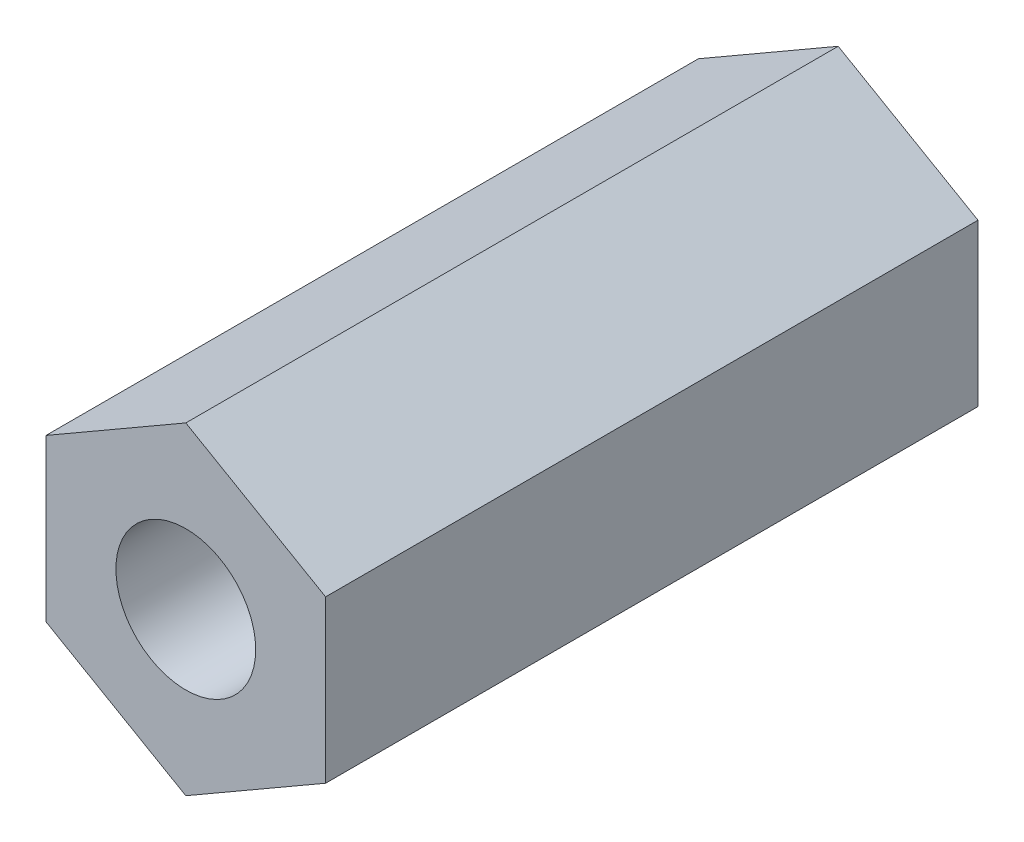
ISO-10303-21;
HEADER;
FILE_DESCRIPTION(('STEP AP214'),'2;1');
FILE_NAME('part.step','',(''),(''),'','','');
FILE_SCHEMA(('AUTOMOTIVE_DESIGN { 1 0 10303 214 1 1 1 1 }'));
ENDSEC;
DATA;
#1=APPLICATION_CONTEXT('core data for automotive mechanical design processes');
#2=APPLICATION_PROTOCOL_DEFINITION('international standard','automotive_design',2000,#1);
#3=PRODUCT_CONTEXT('',#1,'mechanical');
#4=PRODUCT('Part','Part','',(#3));
#5=PRODUCT_RELATED_PRODUCT_CATEGORY('part','',(#4));
#6=PRODUCT_DEFINITION_FORMATION('','',#4);
#7=PRODUCT_DEFINITION_CONTEXT('part definition',#1,'design');
#8=PRODUCT_DEFINITION('design','',#6,#7);
#9=PRODUCT_DEFINITION_SHAPE('','',#8);
#10=(LENGTH_UNIT() NAMED_UNIT(*) SI_UNIT(.MILLI.,.METRE.));
#11=(NAMED_UNIT(*) PLANE_ANGLE_UNIT() SI_UNIT($,.RADIAN.));
#12=(NAMED_UNIT(*) SI_UNIT($,.STERADIAN.) SOLID_ANGLE_UNIT());
#13=UNCERTAINTY_MEASURE_WITH_UNIT(LENGTH_MEASURE(1.E-05),#10,'distance_accuracy_value','');
#14=(GEOMETRIC_REPRESENTATION_CONTEXT(3) GLOBAL_UNCERTAINTY_ASSIGNED_CONTEXT((#13)) GLOBAL_UNIT_ASSIGNED_CONTEXT((#10,
#11,#12)) REPRESENTATION_CONTEXT('',''));
#15=CARTESIAN_POINT('',(0.,0.,0.));
#16=DIRECTION('',(0.,0.,1.));
#17=DIRECTION('',(1.,0.,0.));
#18=AXIS2_PLACEMENT_3D('',#15,#16,#17);
#19=CARTESIAN_POINT('',(0.,3.46410161513769,6.99999999999978));
#20=DIRECTION('',(0.,0.,1.));
#21=DIRECTION('',(1.,0.,0.));
#22=AXIS2_PLACEMENT_3D('',#19,#20,#21);
#23=PLANE('',#22);
#24=DIRECTION('',(-0.866025403784441,0.500000000000001,0.));
#25=VECTOR('',#24,1.);
#26=CARTESIAN_POINT('',(3.00000000000007,1.73205080756883,6.9999999999999));
#27=LINE('',#26,#25);
#28=CARTESIAN_POINT('',(3.00000000000007,1.73205080756883,6.9999999999999));
#29=VERTEX_POINT('',#28);
#30=CARTESIAN_POINT('',(0.,3.46410161513769,6.99999999999978));
#31=VERTEX_POINT('',#30);
#32=EDGE_CURVE('E121',#29,#31,#27,.T.);
#33=ORIENTED_EDGE('',*,*,#32,.T.);
#34=DIRECTION('',(-0.86602540378444,-0.500000000000002,0.));
#35=VECTOR('',#34,1.);
#36=CARTESIAN_POINT('',(0.,3.46410161513769,6.99999999999978));
#37=LINE('',#36,#35);
#38=CARTESIAN_POINT('',(-3.00000000000006,1.73205080756875,7.00000000000001));
#39=VERTEX_POINT('',#38);
#40=EDGE_CURVE('E88',#31,#39,#37,.T.);
#41=ORIENTED_EDGE('',*,*,#40,.T.);
#42=DIRECTION('',(0.,-1.,0.));
#43=VECTOR('',#42,1.);
#44=CARTESIAN_POINT('',(-3.00000000000006,1.73205080756875,7.00000000000001));
#45=LINE('',#44,#43);
#46=CARTESIAN_POINT('',(-3.00000000000001,-1.732050807569,7.00000000000001));
#47=VERTEX_POINT('',#46);
#48=EDGE_CURVE('E124',#39,#47,#45,.T.);
#49=ORIENTED_EDGE('',*,*,#48,.T.);
#50=DIRECTION('',(0.866025403784441,-0.500000000000001,0.));
#51=VECTOR('',#50,1.);
#52=CARTESIAN_POINT('',(-3.00000000000001,-1.732050807569,7.00000000000001));
#53=LINE('',#52,#51);
#54=CARTESIAN_POINT('',(-1.11022302462516E-13,-3.46410161513777,7.00000000000012));
#55=VERTEX_POINT('',#54);
#56=EDGE_CURVE('E126',#47,#55,#53,.T.);
#57=ORIENTED_EDGE('',*,*,#56,.T.);
#58=DIRECTION('',(0.86602540378444,0.500000000000002,0.));
#59=VECTOR('',#58,1.);
#60=CARTESIAN_POINT('',(-1.11022302462516E-13,-3.46410161513777,7.00000000000012));
#61=LINE('',#60,#59);
#62=CARTESIAN_POINT('',(3.00000000000001,-1.73205080756897,7.00000000000012));
#63=VERTEX_POINT('',#62);
#64=EDGE_CURVE('E52',#55,#63,#61,.T.);
#65=ORIENTED_EDGE('',*,*,#64,.T.);
#66=DIRECTION('',(0.,1.,0.));
#67=VECTOR('',#66,1.);
#68=CARTESIAN_POINT('',(3.00000000000001,-1.73205080756897,7.00000000000012));
#69=LINE('',#68,#67);
#70=EDGE_CURVE('E47',#63,#29,#69,.T.);
#71=ORIENTED_EDGE('',*,*,#70,.T.);
#72=EDGE_LOOP('',(#33,#41,#49,#57,#65,#71));
#73=FACE_BOUND('',#72,.T.);
#74=CARTESIAN_POINT('',(0.,0.,7.00000000000001));
#75=DIRECTION('',(0.,0.,1.));
#76=DIRECTION('',(1.,0.,0.));
#77=AXIS2_PLACEMENT_3D('',#74,#75,#76);
#78=CIRCLE('',#77,1.5);
#79=CARTESIAN_POINT('',(1.5,0.,7.00000000000001));
#80=VERTEX_POINT('',#79);
#81=EDGE_CURVE('E118',#80,#80,#78,.T.);
#82=ORIENTED_EDGE('',*,*,#81,.F.);
#83=EDGE_LOOP('',(#82));
#84=FACE_BOUND('',#83,.T.);
#85=ADVANCED_FACE('F32',(#73,#84),#23,.T.);
#86=CARTESIAN_POINT('',(3.00000000000007,1.73205080756883,6.9999999999999));
#87=DIRECTION('',(-0.5,-0.866025403784442,0.));
#88=DIRECTION('',(0.866025403784441,-0.500000000000001,0.));
#89=AXIS2_PLACEMENT_3D('',#86,#87,#88);
#90=PLANE('',#89);
#91=DIRECTION('',(0.,0.,-1.));
#92=VECTOR('',#91,1.);
#93=CARTESIAN_POINT('',(3.00000000000007,1.73205080756883,6.9999999999999));
#94=LINE('',#93,#92);
#95=CARTESIAN_POINT('',(3.00000000000006,1.73205080756877,-7.00000000000012));
#96=VERTEX_POINT('',#95);
#97=EDGE_CURVE('E103',#29,#96,#94,.T.);
#98=ORIENTED_EDGE('',*,*,#97,.T.);
#99=DIRECTION('',(-0.866025403784441,0.500000000000001,0.));
#100=VECTOR('',#99,1.);
#101=CARTESIAN_POINT('',(3.00000000000006,1.73205080756877,-7.00000000000012));
#102=LINE('',#101,#100);
#103=CARTESIAN_POINT('',(-1.17961196366423E-13,3.4641016151376,-7.00000000000023));
#104=VERTEX_POINT('',#103);
#105=EDGE_CURVE('E97',#96,#104,#102,.T.);
#106=ORIENTED_EDGE('',*,*,#105,.T.);
#107=DIRECTION('',(0.,0.,-1.));
#108=VECTOR('',#107,1.);
#109=CARTESIAN_POINT('',(0.,3.46410161513769,6.99999999999978));
#110=LINE('',#109,#108);
#111=EDGE_CURVE('E11',#31,#104,#110,.T.);
#112=ORIENTED_EDGE('',*,*,#111,.F.);
#113=ORIENTED_EDGE('',*,*,#32,.F.);
#114=EDGE_LOOP('',(#98,#106,#112,#113));
#115=FACE_BOUND('',#114,.T.);
#116=ADVANCED_FACE('F34',(#115),#90,.F.);
#117=CARTESIAN_POINT('',(0.,3.46410161513769,6.99999999999978));
#118=DIRECTION('',(0.500000000000002,-0.866025403784441,0.));
#119=DIRECTION('',(0.86602540378444,0.500000000000002,0.));
#120=AXIS2_PLACEMENT_3D('',#117,#118,#119);
#121=PLANE('',#120);
#122=ORIENTED_EDGE('',*,*,#111,.T.);
#123=DIRECTION('',(-0.86602540378444,-0.500000000000002,0.));
#124=VECTOR('',#123,1.);
#125=CARTESIAN_POINT('',(-1.17961196366423E-13,3.4641016151376,-7.00000000000023));
#126=LINE('',#125,#124);
#127=CARTESIAN_POINT('',(-3.00000000000005,1.73205080756872,-7.00000000000001));
#128=VERTEX_POINT('',#127);
#129=EDGE_CURVE('E87',#104,#128,#126,.T.);
#130=ORIENTED_EDGE('',*,*,#129,.T.);
#131=DIRECTION('',(0.,0.,-1.));
#132=VECTOR('',#131,1.);
#133=CARTESIAN_POINT('',(-3.00000000000006,1.73205080756875,7.00000000000001));
#134=LINE('',#133,#132);
#135=EDGE_CURVE('E40',#39,#128,#134,.T.);
#136=ORIENTED_EDGE('',*,*,#135,.F.);
#137=ORIENTED_EDGE('',*,*,#40,.F.);
#138=EDGE_LOOP('',(#122,#130,#136,#137));
#139=FACE_BOUND('',#138,.T.);
#140=ADVANCED_FACE('F85',(#139),#121,.F.);
#141=CARTESIAN_POINT('',(-3.00000000000006,1.73205080756875,7.00000000000001));
#142=DIRECTION('',(1.,0.,0.));
#143=DIRECTION('',(0.,0.,-1.));
#144=AXIS2_PLACEMENT_3D('',#141,#142,#143);
#145=PLANE('',#144);
#146=ORIENTED_EDGE('',*,*,#135,.T.);
#147=DIRECTION('',(0.,-1.,0.));
#148=VECTOR('',#147,1.);
#149=CARTESIAN_POINT('',(-3.00000000000005,1.73205080756872,-7.00000000000001));
#150=LINE('',#149,#148);
#151=CARTESIAN_POINT('',(-3.00000000000001,-1.73205080756905,-7.00000000000001));
#152=VERTEX_POINT('',#151);
#153=EDGE_CURVE('E101',#128,#152,#150,.T.);
#154=ORIENTED_EDGE('',*,*,#153,.T.);
#155=DIRECTION('',(0.,0.,-1.));
#156=VECTOR('',#155,1.);
#157=CARTESIAN_POINT('',(-3.00000000000001,-1.732050807569,7.00000000000001));
#158=LINE('',#157,#156);
#159=EDGE_CURVE('E135',#47,#152,#158,.T.);
#160=ORIENTED_EDGE('',*,*,#159,.F.);
#161=ORIENTED_EDGE('',*,*,#48,.F.);
#162=EDGE_LOOP('',(#146,#154,#160,#161));
#163=FACE_BOUND('',#162,.T.);
#164=ADVANCED_FACE('F138',(#163),#145,.F.);
#165=CARTESIAN_POINT('',(-3.00000000000001,-1.732050807569,7.00000000000001));
#166=DIRECTION('',(0.5,0.866025403784442,0.));
#167=DIRECTION('',(-0.866025403784441,0.500000000000001,0.));
#168=AXIS2_PLACEMENT_3D('',#165,#166,#167);
#169=PLANE('',#168);
#170=ORIENTED_EDGE('',*,*,#159,.T.);
#171=DIRECTION('',(0.866025403784441,-0.500000000000001,0.));
#172=VECTOR('',#171,1.);
#173=CARTESIAN_POINT('',(-3.00000000000001,-1.73205080756905,-7.00000000000001));
#174=LINE('',#173,#172);
#175=CARTESIAN_POINT('',(0.,-3.46410161513799,-6.9999999999999));
#176=VERTEX_POINT('',#175);
#177=EDGE_CURVE('E110',#152,#176,#174,.T.);
#178=ORIENTED_EDGE('',*,*,#177,.T.);
#179=DIRECTION('',(0.,0.,-1.));
#180=VECTOR('',#179,1.);
#181=CARTESIAN_POINT('',(-1.11022302462516E-13,-3.46410161513777,7.00000000000012));
#182=LINE('',#181,#180);
#183=EDGE_CURVE('E133',#55,#176,#182,.T.);
#184=ORIENTED_EDGE('',*,*,#183,.F.);
#185=ORIENTED_EDGE('',*,*,#56,.F.);
#186=EDGE_LOOP('',(#170,#178,#184,#185));
#187=FACE_BOUND('',#186,.T.);
#188=ADVANCED_FACE('F144',(#187),#169,.F.);
#189=CARTESIAN_POINT('',(-1.11022302462516E-13,-3.46410161513777,7.00000000000012));
#190=DIRECTION('',(-0.500000000000002,0.866025403784442,0.));
#191=DIRECTION('',(-0.86602540378444,-0.500000000000002,0.));
#192=AXIS2_PLACEMENT_3D('',#189,#190,#191);
#193=PLANE('',#192);
#194=ORIENTED_EDGE('',*,*,#183,.T.);
#195=DIRECTION('',(0.86602540378444,0.500000000000002,0.));
#196=VECTOR('',#195,1.);
#197=CARTESIAN_POINT('',(0.,-3.46410161513799,-6.9999999999999));
#198=LINE('',#197,#196);
#199=CARTESIAN_POINT('',(3.00000000000001,-1.73205080756902,-6.9999999999999));
#200=VERTEX_POINT('',#199);
#201=EDGE_CURVE('E113',#176,#200,#198,.T.);
#202=ORIENTED_EDGE('',*,*,#201,.T.);
#203=DIRECTION('',(0.,0.,-1.));
#204=VECTOR('',#203,1.);
#205=CARTESIAN_POINT('',(3.00000000000001,-1.73205080756897,7.00000000000012));
#206=LINE('',#205,#204);
#207=EDGE_CURVE('E131',#63,#200,#206,.T.);
#208=ORIENTED_EDGE('',*,*,#207,.F.);
#209=ORIENTED_EDGE('',*,*,#64,.F.);
#210=EDGE_LOOP('',(#194,#202,#208,#209));
#211=FACE_BOUND('',#210,.T.);
#212=ADVANCED_FACE('F147',(#211),#193,.F.);
#213=CARTESIAN_POINT('',(3.00000000000001,-1.73205080756897,7.00000000000012));
#214=DIRECTION('',(-1.,0.,0.));
#215=DIRECTION('',(0.,-1.,0.));
#216=AXIS2_PLACEMENT_3D('',#213,#214,#215);
#217=PLANE('',#216);
#218=ORIENTED_EDGE('',*,*,#207,.T.);
#219=DIRECTION('',(0.,1.,0.));
#220=VECTOR('',#219,1.);
#221=CARTESIAN_POINT('',(3.00000000000001,-1.73205080756902,-6.9999999999999));
#222=LINE('',#221,#220);
#223=EDGE_CURVE('E116',#200,#96,#222,.T.);
#224=ORIENTED_EDGE('',*,*,#223,.T.);
#225=ORIENTED_EDGE('',*,*,#97,.F.);
#226=ORIENTED_EDGE('',*,*,#70,.F.);
#227=EDGE_LOOP('',(#218,#224,#225,#226));
#228=FACE_BOUND('',#227,.T.);
#229=ADVANCED_FACE('F149',(#228),#217,.F.);
#230=CARTESIAN_POINT('',(0.,0.,7.00000000000001));
#231=DIRECTION('',(0.,0.,-1.));
#232=DIRECTION('',(-1.,0.,0.));
#233=AXIS2_PLACEMENT_3D('',#230,#231,#232);
#234=CYLINDRICAL_SURFACE('',#233,1.5);
#235=ORIENTED_EDGE('',*,*,#81,.T.);
#236=EDGE_LOOP('',(#235));
#237=FACE_BOUND('',#236,.T.);
#238=CARTESIAN_POINT('',(0.,0.,-7.00000000000001));
#239=DIRECTION('',(0.,0.,1.));
#240=DIRECTION('',(1.,0.,0.));
#241=AXIS2_PLACEMENT_3D('',#238,#239,#240);
#242=CIRCLE('',#241,1.5);
#243=CARTESIAN_POINT('',(1.5,0.,-7.00000000000001));
#244=VERTEX_POINT('',#243);
#245=EDGE_CURVE('E104',#244,#244,#242,.T.);
#246=ORIENTED_EDGE('',*,*,#245,.F.);
#247=EDGE_LOOP('',(#246));
#248=FACE_BOUND('',#247,.T.);
#249=ADVANCED_FACE('F151',(#237,#248),#234,.F.);
#250=CARTESIAN_POINT('',(-1.17961196366423E-13,3.4641016151376,-7.00000000000023));
#251=DIRECTION('',(0.,0.,1.));
#252=DIRECTION('',(1.,0.,0.));
#253=AXIS2_PLACEMENT_3D('',#250,#251,#252);
#254=PLANE('',#253);
#255=ORIENTED_EDGE('',*,*,#245,.T.);
#256=EDGE_LOOP('',(#255));
#257=FACE_BOUND('',#256,.T.);
#258=ORIENTED_EDGE('',*,*,#105,.F.);
#259=ORIENTED_EDGE('',*,*,#223,.F.);
#260=ORIENTED_EDGE('',*,*,#201,.F.);
#261=ORIENTED_EDGE('',*,*,#177,.F.);
#262=ORIENTED_EDGE('',*,*,#153,.F.);
#263=ORIENTED_EDGE('',*,*,#129,.F.);
#264=EDGE_LOOP('',(#258,#259,#260,#261,#262,#263));
#265=FACE_BOUND('',#264,.T.);
#266=ADVANCED_FACE('F95',(#257,#265),#254,.F.);
#267=CLOSED_SHELL('',(#85,#116,#140,#164,#188,#212,#229,#249,#266));
#268=MANIFOLD_SOLID_BREP('B2',#267);
#269=ADVANCED_BREP_SHAPE_REPRESENTATION('',(#18,#268),#14);
#270=SHAPE_DEFINITION_REPRESENTATION(#9,#269);
ENDSEC;
END-ISO-10303-21;
